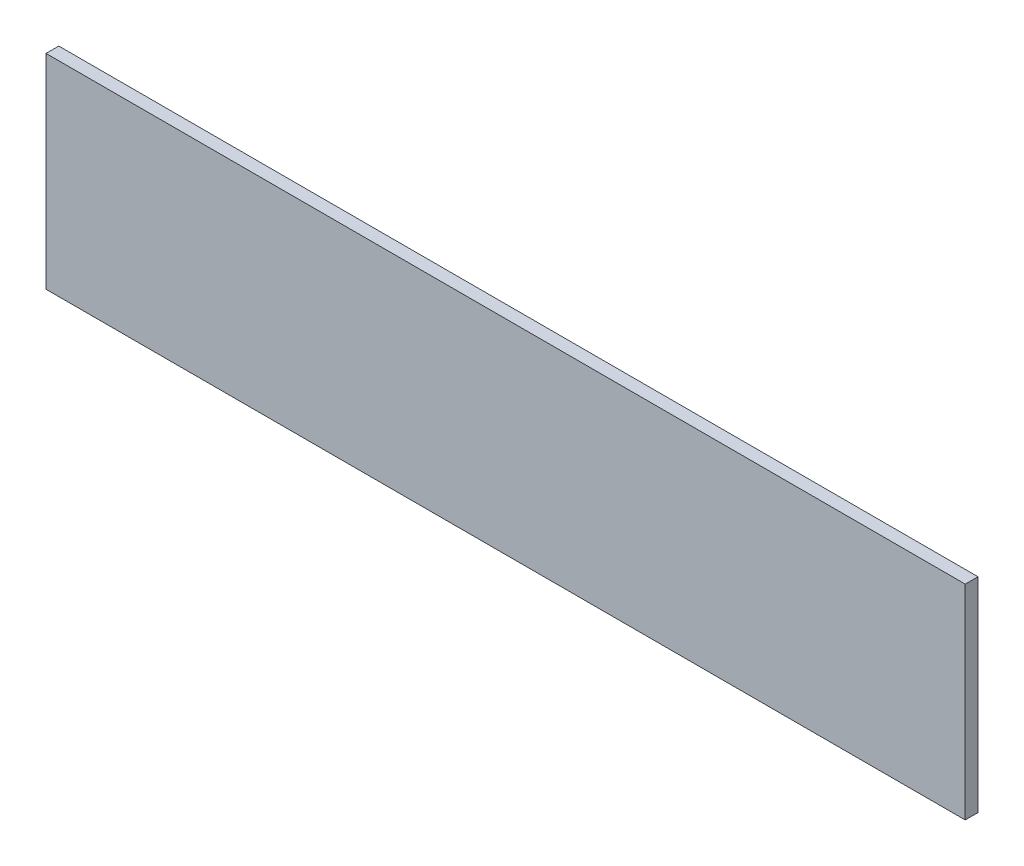
ISO-10303-21;
HEADER;
FILE_DESCRIPTION(('STEP AP214'),'2;1');
FILE_NAME('part.step','',(''),(''),'','','');
FILE_SCHEMA(('AUTOMOTIVE_DESIGN { 1 0 10303 214 1 1 1 1 }'));
ENDSEC;
DATA;
#1=APPLICATION_CONTEXT('core data for automotive mechanical design processes');
#2=APPLICATION_PROTOCOL_DEFINITION('international standard','automotive_design',2000,#1);
#3=PRODUCT_CONTEXT('',#1,'mechanical');
#4=PRODUCT('Part','Part','',(#3));
#5=PRODUCT_RELATED_PRODUCT_CATEGORY('part','',(#4));
#6=PRODUCT_DEFINITION_FORMATION('','',#4);
#7=PRODUCT_DEFINITION_CONTEXT('part definition',#1,'design');
#8=PRODUCT_DEFINITION('design','',#6,#7);
#9=PRODUCT_DEFINITION_SHAPE('','',#8);
#10=(LENGTH_UNIT() NAMED_UNIT(*) SI_UNIT(.MILLI.,.METRE.));
#11=(NAMED_UNIT(*) PLANE_ANGLE_UNIT() SI_UNIT($,.RADIAN.));
#12=(NAMED_UNIT(*) SI_UNIT($,.STERADIAN.) SOLID_ANGLE_UNIT());
#13=UNCERTAINTY_MEASURE_WITH_UNIT(LENGTH_MEASURE(1.E-05),#10,'distance_accuracy_value','');
#14=(GEOMETRIC_REPRESENTATION_CONTEXT(3) GLOBAL_UNCERTAINTY_ASSIGNED_CONTEXT((#13)) GLOBAL_UNIT_ASSIGNED_CONTEXT((#10,
#11,#12)) REPRESENTATION_CONTEXT('',''));
#15=CARTESIAN_POINT('',(0.,0.,0.));
#16=DIRECTION('',(0.,0.,1.));
#17=DIRECTION('',(1.,0.,0.));
#18=AXIS2_PLACEMENT_3D('',#15,#16,#17);
#19=CARTESIAN_POINT('',(0.,0.,3.175));
#20=DIRECTION('',(-1.,0.,0.));
#21=DIRECTION('',(0.,0.,1.));
#22=AXIS2_PLACEMENT_3D('',#19,#20,#21);
#23=PLANE('',#22);
#24=DIRECTION('',(0.,1.,0.));
#25=VECTOR('',#24,1.);
#26=CARTESIAN_POINT('',(0.,0.,0.));
#27=LINE('',#26,#25);
#28=CARTESIAN_POINT('',(0.,-50.8,0.));
#29=VERTEX_POINT('',#28);
#30=CARTESIAN_POINT('',(0.,0.,0.));
#31=VERTEX_POINT('',#30);
#32=EDGE_CURVE('E95',#29,#31,#27,.T.);
#33=ORIENTED_EDGE('',*,*,#32,.T.);
#34=DIRECTION('',(0.,0.,-1.));
#35=VECTOR('',#34,1.);
#36=CARTESIAN_POINT('',(0.,0.,3.175));
#37=LINE('',#36,#35);
#38=CARTESIAN_POINT('',(0.,0.,3.175));
#39=VERTEX_POINT('',#38);
#40=EDGE_CURVE('E11',#39,#31,#37,.T.);
#41=ORIENTED_EDGE('',*,*,#40,.F.);
#42=DIRECTION('',(0.,1.,0.));
#43=VECTOR('',#42,1.);
#44=CARTESIAN_POINT('',(0.,0.,3.175));
#45=LINE('',#44,#43);
#46=CARTESIAN_POINT('',(0.,-50.8,3.175));
#47=VERTEX_POINT('',#46);
#48=EDGE_CURVE('E83',#47,#39,#45,.T.);
#49=ORIENTED_EDGE('',*,*,#48,.F.);
#50=DIRECTION('',(0.,0.,-1.));
#51=VECTOR('',#50,1.);
#52=CARTESIAN_POINT('',(0.,-50.8,3.175));
#53=LINE('',#52,#51);
#54=EDGE_CURVE('E91',#47,#29,#53,.T.);
#55=ORIENTED_EDGE('',*,*,#54,.T.);
#56=EDGE_LOOP('',(#33,#41,#49,#55));
#57=FACE_BOUND('',#56,.T.);
#58=ADVANCED_FACE('F32',(#57),#23,.F.);
#59=CARTESIAN_POINT('',(0.,0.,3.175));
#60=DIRECTION('',(0.,-1.,0.));
#61=DIRECTION('',(1.,0.,0.));
#62=AXIS2_PLACEMENT_3D('',#59,#60,#61);
#63=PLANE('',#62);
#64=DIRECTION('',(-1.,0.,0.));
#65=VECTOR('',#64,1.);
#66=CARTESIAN_POINT('',(0.,0.,0.));
#67=LINE('',#66,#65);
#68=CARTESIAN_POINT('',(-228.6,0.,0.));
#69=VERTEX_POINT('',#68);
#70=EDGE_CURVE('E87',#31,#69,#67,.T.);
#71=ORIENTED_EDGE('',*,*,#70,.T.);
#72=DIRECTION('',(0.,0.,-1.));
#73=VECTOR('',#72,1.);
#74=CARTESIAN_POINT('',(-228.6,0.,3.175));
#75=LINE('',#74,#73);
#76=CARTESIAN_POINT('',(-228.6,0.,3.175));
#77=VERTEX_POINT('',#76);
#78=EDGE_CURVE('E40',#77,#69,#75,.T.);
#79=ORIENTED_EDGE('',*,*,#78,.F.);
#80=DIRECTION('',(-1.,0.,0.));
#81=VECTOR('',#80,1.);
#82=CARTESIAN_POINT('',(0.,0.,3.175));
#83=LINE('',#82,#81);
#84=EDGE_CURVE('E78',#39,#77,#83,.T.);
#85=ORIENTED_EDGE('',*,*,#84,.F.);
#86=ORIENTED_EDGE('',*,*,#40,.T.);
#87=EDGE_LOOP('',(#71,#79,#85,#86));
#88=FACE_BOUND('',#87,.T.);
#89=ADVANCED_FACE('F86',(#88),#63,.F.);
#90=CARTESIAN_POINT('',(-228.6,0.,3.175));
#91=DIRECTION('',(1.,0.,0.));
#92=DIRECTION('',(0.,0.,-1.));
#93=AXIS2_PLACEMENT_3D('',#90,#91,#92);
#94=PLANE('',#93);
#95=DIRECTION('',(0.,-1.,0.));
#96=VECTOR('',#95,1.);
#97=CARTESIAN_POINT('',(-228.6,0.,0.));
#98=LINE('',#97,#96);
#99=CARTESIAN_POINT('',(-228.6,-50.8,0.));
#100=VERTEX_POINT('',#99);
#101=EDGE_CURVE('E65',#69,#100,#98,.T.);
#102=ORIENTED_EDGE('',*,*,#101,.T.);
#103=DIRECTION('',(0.,0.,-1.));
#104=VECTOR('',#103,1.);
#105=CARTESIAN_POINT('',(-228.6,-50.8,3.175));
#106=LINE('',#105,#104);
#107=CARTESIAN_POINT('',(-228.6,-50.8,3.175));
#108=VERTEX_POINT('',#107);
#109=EDGE_CURVE('E88',#108,#100,#106,.T.);
#110=ORIENTED_EDGE('',*,*,#109,.F.);
#111=DIRECTION('',(0.,-1.,0.));
#112=VECTOR('',#111,1.);
#113=CARTESIAN_POINT('',(-228.6,0.,3.175));
#114=LINE('',#113,#112);
#115=EDGE_CURVE('E81',#77,#108,#114,.T.);
#116=ORIENTED_EDGE('',*,*,#115,.F.);
#117=ORIENTED_EDGE('',*,*,#78,.T.);
#118=EDGE_LOOP('',(#102,#110,#116,#117));
#119=FACE_BOUND('',#118,.T.);
#120=ADVANCED_FACE('F89',(#119),#94,.F.);
#121=CARTESIAN_POINT('',(0.,-50.8,3.175));
#122=DIRECTION('',(0.,1.,0.));
#123=DIRECTION('',(-1.,0.,0.));
#124=AXIS2_PLACEMENT_3D('',#121,#122,#123);
#125=PLANE('',#124);
#126=DIRECTION('',(1.,0.,0.));
#127=VECTOR('',#126,1.);
#128=CARTESIAN_POINT('',(0.,-50.8,0.));
#129=LINE('',#128,#127);
#130=EDGE_CURVE('E71',#100,#29,#129,.T.);
#131=ORIENTED_EDGE('',*,*,#130,.T.);
#132=ORIENTED_EDGE('',*,*,#54,.F.);
#133=DIRECTION('',(1.,0.,0.));
#134=VECTOR('',#133,1.);
#135=CARTESIAN_POINT('',(0.,-50.8,3.175));
#136=LINE('',#135,#134);
#137=EDGE_CURVE('E48',#108,#47,#136,.T.);
#138=ORIENTED_EDGE('',*,*,#137,.F.);
#139=ORIENTED_EDGE('',*,*,#109,.T.);
#140=EDGE_LOOP('',(#131,#132,#138,#139));
#141=FACE_BOUND('',#140,.T.);
#142=ADVANCED_FACE('F102',(#141),#125,.F.);
#143=CARTESIAN_POINT('',(0.,0.,3.175));
#144=DIRECTION('',(0.,0.,-1.));
#145=DIRECTION('',(-1.,0.,0.));
#146=AXIS2_PLACEMENT_3D('',#143,#144,#145);
#147=PLANE('',#146);
#148=ORIENTED_EDGE('',*,*,#48,.T.);
#149=ORIENTED_EDGE('',*,*,#84,.T.);
#150=ORIENTED_EDGE('',*,*,#115,.T.);
#151=ORIENTED_EDGE('',*,*,#137,.T.);
#152=EDGE_LOOP('',(#148,#149,#150,#151));
#153=FACE_BOUND('',#152,.T.);
#154=ADVANCED_FACE('F79',(#153),#147,.F.);
#155=CARTESIAN_POINT('',(0.,0.,0.));
#156=DIRECTION('',(0.,0.,-1.));
#157=DIRECTION('',(-1.,0.,0.));
#158=AXIS2_PLACEMENT_3D('',#155,#156,#157);
#159=PLANE('',#158);
#160=ORIENTED_EDGE('',*,*,#32,.F.);
#161=ORIENTED_EDGE('',*,*,#130,.F.);
#162=ORIENTED_EDGE('',*,*,#101,.F.);
#163=ORIENTED_EDGE('',*,*,#70,.F.);
#164=EDGE_LOOP('',(#160,#161,#162,#163));
#165=FACE_BOUND('',#164,.T.);
#166=ADVANCED_FACE('F105',(#165),#159,.T.);
#167=CLOSED_SHELL('',(#58,#89,#120,#142,#154,#166));
#168=MANIFOLD_SOLID_BREP('B2',#167);
#169=ADVANCED_BREP_SHAPE_REPRESENTATION('',(#18,#168),#14);
#170=SHAPE_DEFINITION_REPRESENTATION(#9,#169);
ENDSEC;
END-ISO-10303-21;
